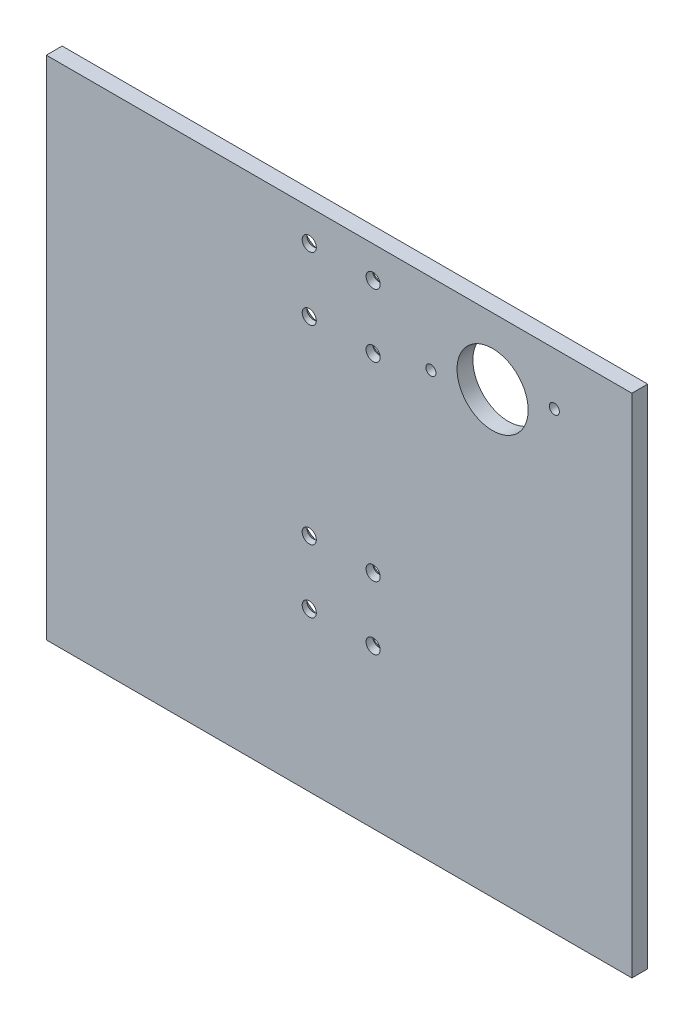
ISO-10303-21;
HEADER;
FILE_DESCRIPTION(('STEP AP214'),'2;1');
FILE_NAME('part.step','',(''),(''),'','','');
FILE_SCHEMA(('AUTOMOTIVE_DESIGN { 1 0 10303 214 1 1 1 1 }'));
ENDSEC;
DATA;
#1=APPLICATION_CONTEXT('core data for automotive mechanical design processes');
#2=APPLICATION_PROTOCOL_DEFINITION('international standard','automotive_design',2000,#1);
#3=PRODUCT_CONTEXT('',#1,'mechanical');
#4=PRODUCT('Part','Part','',(#3));
#5=PRODUCT_RELATED_PRODUCT_CATEGORY('part','',(#4));
#6=PRODUCT_DEFINITION_FORMATION('','',#4);
#7=PRODUCT_DEFINITION_CONTEXT('part definition',#1,'design');
#8=PRODUCT_DEFINITION('design','',#6,#7);
#9=PRODUCT_DEFINITION_SHAPE('','',#8);
#10=(LENGTH_UNIT() NAMED_UNIT(*) SI_UNIT(.MILLI.,.METRE.));
#11=(NAMED_UNIT(*) PLANE_ANGLE_UNIT() SI_UNIT($,.RADIAN.));
#12=(NAMED_UNIT(*) SI_UNIT($,.STERADIAN.) SOLID_ANGLE_UNIT());
#13=UNCERTAINTY_MEASURE_WITH_UNIT(LENGTH_MEASURE(1.E-05),#10,'distance_accuracy_value','');
#14=(GEOMETRIC_REPRESENTATION_CONTEXT(3) GLOBAL_UNCERTAINTY_ASSIGNED_CONTEXT((#13)) GLOBAL_UNIT_ASSIGNED_CONTEXT((#10,
#11,#12)) REPRESENTATION_CONTEXT('',''));
#15=CARTESIAN_POINT('',(0.,0.,0.));
#16=DIRECTION('',(0.,0.,1.));
#17=DIRECTION('',(1.,0.,0.));
#18=AXIS2_PLACEMENT_3D('',#15,#16,#17);
#19=CARTESIAN_POINT('',(117.475,-101.6,6.35));
#20=DIRECTION('',(-1.,0.,0.));
#21=DIRECTION('',(0.,0.,1.));
#22=AXIS2_PLACEMENT_3D('',#19,#20,#21);
#23=PLANE('',#22);
#24=DIRECTION('',(0.,1.,0.));
#25=VECTOR('',#24,1.);
#26=CARTESIAN_POINT('',(117.475,-101.6,0.));
#27=LINE('',#26,#25);
#28=CARTESIAN_POINT('',(117.475,-101.6,0.));
#29=VERTEX_POINT('',#28);
#30=CARTESIAN_POINT('',(117.475,101.6,0.));
#31=VERTEX_POINT('',#30);
#32=EDGE_CURVE('E104',#29,#31,#27,.T.);
#33=ORIENTED_EDGE('',*,*,#32,.T.);
#34=DIRECTION('',(0.,0.,-1.));
#35=VECTOR('',#34,1.);
#36=CARTESIAN_POINT('',(117.475,101.6,6.35));
#37=LINE('',#36,#35);
#38=CARTESIAN_POINT('',(117.475,101.6,6.35));
#39=VERTEX_POINT('',#38);
#40=EDGE_CURVE('E11',#39,#31,#37,.T.);
#41=ORIENTED_EDGE('',*,*,#40,.F.);
#42=DIRECTION('',(0.,1.,0.));
#43=VECTOR('',#42,1.);
#44=CARTESIAN_POINT('',(117.475,-101.6,6.35));
#45=LINE('',#44,#43);
#46=CARTESIAN_POINT('',(117.475,-101.6,6.35));
#47=VERTEX_POINT('',#46);
#48=EDGE_CURVE('E91',#47,#39,#45,.T.);
#49=ORIENTED_EDGE('',*,*,#48,.F.);
#50=DIRECTION('',(0.,0.,-1.));
#51=VECTOR('',#50,1.);
#52=CARTESIAN_POINT('',(117.475,-101.6,6.35));
#53=LINE('',#52,#51);
#54=EDGE_CURVE('E100',#47,#29,#53,.T.);
#55=ORIENTED_EDGE('',*,*,#54,.T.);
#56=EDGE_LOOP('',(#33,#41,#49,#55));
#57=FACE_BOUND('',#56,.T.);
#58=ADVANCED_FACE('F38',(#57),#23,.F.);
#59=CARTESIAN_POINT('',(-117.475,101.6,6.35));
#60=DIRECTION('',(0.,-1.,0.));
#61=DIRECTION('',(0.,0.,-1.));
#62=AXIS2_PLACEMENT_3D('',#59,#60,#61);
#63=PLANE('',#62);
#64=DIRECTION('',(-1.,0.,0.));
#65=VECTOR('',#64,1.);
#66=CARTESIAN_POINT('',(-117.475,101.6,0.));
#67=LINE('',#66,#65);
#68=CARTESIAN_POINT('',(-117.475,101.6,0.));
#69=VERTEX_POINT('',#68);
#70=EDGE_CURVE('E95',#31,#69,#67,.T.);
#71=ORIENTED_EDGE('',*,*,#70,.T.);
#72=DIRECTION('',(0.,0.,-1.));
#73=VECTOR('',#72,1.);
#74=CARTESIAN_POINT('',(-117.475,101.6,6.35));
#75=LINE('',#74,#73);
#76=CARTESIAN_POINT('',(-117.475,101.6,6.35));
#77=VERTEX_POINT('',#76);
#78=EDGE_CURVE('E47',#77,#69,#75,.T.);
#79=ORIENTED_EDGE('',*,*,#78,.F.);
#80=DIRECTION('',(-1.,0.,0.));
#81=VECTOR('',#80,1.);
#82=CARTESIAN_POINT('',(-117.475,101.6,6.35));
#83=LINE('',#82,#81);
#84=EDGE_CURVE('E86',#39,#77,#83,.T.);
#85=ORIENTED_EDGE('',*,*,#84,.F.);
#86=ORIENTED_EDGE('',*,*,#40,.T.);
#87=EDGE_LOOP('',(#71,#79,#85,#86));
#88=FACE_BOUND('',#87,.T.);
#89=ADVANCED_FACE('F94',(#88),#63,.F.);
#90=CARTESIAN_POINT('',(-117.475,-101.6,6.35));
#91=DIRECTION('',(1.,0.,0.));
#92=DIRECTION('',(0.,0.,-1.));
#93=AXIS2_PLACEMENT_3D('',#90,#91,#92);
#94=PLANE('',#93);
#95=DIRECTION('',(0.,-1.,0.));
#96=VECTOR('',#95,1.);
#97=CARTESIAN_POINT('',(-117.475,-101.6,0.));
#98=LINE('',#97,#96);
#99=CARTESIAN_POINT('',(-117.475,-101.6,0.));
#100=VERTEX_POINT('',#99);
#101=EDGE_CURVE('E73',#69,#100,#98,.T.);
#102=ORIENTED_EDGE('',*,*,#101,.T.);
#103=DIRECTION('',(0.,0.,-1.));
#104=VECTOR('',#103,1.);
#105=CARTESIAN_POINT('',(-117.475,-101.6,6.35));
#106=LINE('',#105,#104);
#107=CARTESIAN_POINT('',(-117.475,-101.6,6.35));
#108=VERTEX_POINT('',#107);
#109=EDGE_CURVE('E96',#108,#100,#106,.T.);
#110=ORIENTED_EDGE('',*,*,#109,.F.);
#111=DIRECTION('',(0.,-1.,0.));
#112=VECTOR('',#111,1.);
#113=CARTESIAN_POINT('',(-117.475,-101.6,6.35));
#114=LINE('',#113,#112);
#115=EDGE_CURVE('E89',#77,#108,#114,.T.);
#116=ORIENTED_EDGE('',*,*,#115,.F.);
#117=ORIENTED_EDGE('',*,*,#78,.T.);
#118=EDGE_LOOP('',(#102,#110,#116,#117));
#119=FACE_BOUND('',#118,.T.);
#120=ADVANCED_FACE('F98',(#119),#94,.F.);
#121=CARTESIAN_POINT('',(-117.475,-101.6,6.35));
#122=DIRECTION('',(0.,1.,0.));
#123=DIRECTION('',(0.,0.,1.));
#124=AXIS2_PLACEMENT_3D('',#121,#122,#123);
#125=PLANE('',#124);
#126=DIRECTION('',(1.,0.,0.));
#127=VECTOR('',#126,1.);
#128=CARTESIAN_POINT('',(-117.475,-101.6,0.));
#129=LINE('',#128,#127);
#130=EDGE_CURVE('E79',#100,#29,#129,.T.);
#131=ORIENTED_EDGE('',*,*,#130,.T.);
#132=ORIENTED_EDGE('',*,*,#54,.F.);
#133=DIRECTION('',(1.,0.,0.));
#134=VECTOR('',#133,1.);
#135=CARTESIAN_POINT('',(-117.475,-101.6,6.35));
#136=LINE('',#135,#134);
#137=EDGE_CURVE('E56',#108,#47,#136,.T.);
#138=ORIENTED_EDGE('',*,*,#137,.F.);
#139=ORIENTED_EDGE('',*,*,#109,.T.);
#140=EDGE_LOOP('',(#131,#132,#138,#139));
#141=FACE_BOUND('',#140,.T.);
#142=ADVANCED_FACE('F203',(#141),#125,.F.);
#143=CARTESIAN_POINT('',(0.,0.,6.35));
#144=DIRECTION('',(0.,0.,-1.));
#145=DIRECTION('',(-1.,0.,0.));
#146=AXIS2_PLACEMENT_3D('',#143,#144,#145);
#147=PLANE('',#146);
#148=CARTESIAN_POINT('',(86.3555520435341,80.5934850148182,6.35));
#149=DIRECTION('',(0.,0.,-1.));
#150=DIRECTION('',(-1.,0.,0.));
#151=AXIS2_PLACEMENT_3D('',#148,#149,#150);
#152=CIRCLE('',#151,2.0193);
#153=CARTESIAN_POINT('',(84.3362520435341,80.5934850148182,6.35));
#154=VERTEX_POINT('',#153);
#155=EDGE_CURVE('E169',#154,#154,#152,.T.);
#156=ORIENTED_EDGE('',*,*,#155,.T.);
#157=EDGE_LOOP('',(#156));
#158=FACE_BOUND('',#157,.T.);
#159=CARTESIAN_POINT('',(36.834447956951,69.266514985468,6.35));
#160=DIRECTION('',(0.,0.,-1.));
#161=DIRECTION('',(-1.,0.,0.));
#162=AXIS2_PLACEMENT_3D('',#159,#160,#161);
#163=CIRCLE('',#162,2.0193);
#164=CARTESIAN_POINT('',(34.815147956951,69.266514985468,6.35));
#165=VERTEX_POINT('',#164);
#166=EDGE_CURVE('E178',#165,#165,#163,.T.);
#167=ORIENTED_EDGE('',*,*,#166,.T.);
#168=EDGE_LOOP('',(#167));
#169=FACE_BOUND('',#168,.T.);
#170=CARTESIAN_POINT('',(13.6552562516194,-38.0999999999797,6.35));
#171=DIRECTION('',(0.,0.,-1.));
#172=DIRECTION('',(-1.,0.,0.));
#173=AXIS2_PLACEMENT_3D('',#170,#171,#172);
#174=ELLIPSE('',#173,2.83258676501395,2.80669999999999);
#175=CARTESIAN_POINT('',(10.8226694866054,-38.0999999999797,6.35));
#176=VERTEX_POINT('',#175);
#177=EDGE_CURVE('E162',#176,#176,#174,.T.);
#178=ORIENTED_EDGE('',*,*,#177,.T.);
#179=EDGE_LOOP('',(#178));
#180=FACE_BOUND('',#179,.T.);
#181=CARTESIAN_POINT('',(13.6552562516194,-12.6999999999796,6.35));
#182=DIRECTION('',(0.,0.,-1.));
#183=DIRECTION('',(-1.,0.,0.));
#184=AXIS2_PLACEMENT_3D('',#181,#182,#183);
#185=ELLIPSE('',#184,2.83258676501395,2.80669999999999);
#186=CARTESIAN_POINT('',(10.8226694866054,-12.6999999999796,6.35));
#187=VERTEX_POINT('',#186);
#188=EDGE_CURVE('E156',#187,#187,#185,.T.);
#189=ORIENTED_EDGE('',*,*,#188,.T.);
#190=EDGE_LOOP('',(#189));
#191=FACE_BOUND('',#190,.T.);
#192=CARTESIAN_POINT('',(13.6551371688923,63.499999999998,6.35));
#193=DIRECTION('',(0.,0.,-1.));
#194=DIRECTION('',(-1.,0.,0.));
#195=AXIS2_PLACEMENT_3D('',#192,#193,#194);
#196=ELLIPSE('',#195,2.83258676501395,2.8067);
#197=CARTESIAN_POINT('',(10.8225504038783,63.499999999998,6.35));
#198=VERTEX_POINT('',#197);
#199=EDGE_CURVE('E149',#198,#198,#196,.T.);
#200=ORIENTED_EDGE('',*,*,#199,.T.);
#201=EDGE_LOOP('',(#200));
#202=FACE_BOUND('',#201,.T.);
#203=CARTESIAN_POINT('',(13.6551371688923,88.899999999998,6.35));
#204=DIRECTION('',(0.,0.,-1.));
#205=DIRECTION('',(-1.,0.,0.));
#206=AXIS2_PLACEMENT_3D('',#203,#204,#205);
#207=ELLIPSE('',#206,2.83258676501395,2.8067);
#208=CARTESIAN_POINT('',(10.8225504038783,88.899999999998,6.35));
#209=VERTEX_POINT('',#208);
#210=EDGE_CURVE('E145',#209,#209,#207,.T.);
#211=ORIENTED_EDGE('',*,*,#210,.T.);
#212=EDGE_LOOP('',(#211));
#213=FACE_BOUND('',#212,.T.);
#214=CARTESIAN_POINT('',(-11.9790131150228,-38.0999999999797,6.35));
#215=DIRECTION('',(0.,0.,-1.));
#216=DIRECTION('',(-1.,0.,0.));
#217=AXIS2_PLACEMENT_3D('',#214,#215,#216);
#218=ELLIPSE('',#217,2.83258676501394,2.80669999999998);
#219=CARTESIAN_POINT('',(-14.8115998800367,-38.0999999999797,6.35));
#220=VERTEX_POINT('',#219);
#221=EDGE_CURVE('E135',#220,#220,#218,.T.);
#222=ORIENTED_EDGE('',*,*,#221,.T.);
#223=EDGE_LOOP('',(#222));
#224=FACE_BOUND('',#223,.T.);
#225=CARTESIAN_POINT('',(-11.9790131150228,-12.6999999999797,6.35));
#226=DIRECTION('',(0.,0.,-1.));
#227=DIRECTION('',(-1.,0.,0.));
#228=AXIS2_PLACEMENT_3D('',#225,#226,#227);
#229=ELLIPSE('',#228,2.83258676501394,2.80669999999998);
#230=CARTESIAN_POINT('',(-14.8115998800367,-12.6999999999797,6.35));
#231=VERTEX_POINT('',#230);
#232=EDGE_CURVE('E131',#231,#231,#229,.T.);
#233=ORIENTED_EDGE('',*,*,#232,.T.);
#234=EDGE_LOOP('',(#233));
#235=FACE_BOUND('',#234,.T.);
#236=CARTESIAN_POINT('',(-11.9791321977499,63.499999999998,6.35));
#237=DIRECTION('',(0.,0.,-1.));
#238=DIRECTION('',(-1.,0.,0.));
#239=AXIS2_PLACEMENT_3D('',#236,#237,#238);
#240=ELLIPSE('',#239,2.83258676501394,2.80669999999998);
#241=CARTESIAN_POINT('',(-14.8117189627638,63.499999999998,6.35));
#242=VERTEX_POINT('',#241);
#243=EDGE_CURVE('E124',#242,#242,#240,.T.);
#244=ORIENTED_EDGE('',*,*,#243,.T.);
#245=EDGE_LOOP('',(#244));
#246=FACE_BOUND('',#245,.T.);
#247=CARTESIAN_POINT('',(-11.9791321977499,88.899999999998,6.35));
#248=DIRECTION('',(0.,0.,-1.));
#249=DIRECTION('',(-1.,0.,0.));
#250=AXIS2_PLACEMENT_3D('',#247,#248,#249);
#251=ELLIPSE('',#250,2.83258676501394,2.80669999999998);
#252=CARTESIAN_POINT('',(-14.8117189627638,88.899999999998,6.35));
#253=VERTEX_POINT('',#252);
#254=EDGE_CURVE('E113',#253,#253,#251,.T.);
#255=ORIENTED_EDGE('',*,*,#254,.T.);
#256=EDGE_LOOP('',(#255));
#257=FACE_BOUND('',#256,.T.);
#258=CARTESIAN_POINT('',(61.595,74.93,6.35));
#259=DIRECTION('',(0.,0.,1.));
#260=DIRECTION('',(1.,0.,0.));
#261=AXIS2_PLACEMENT_3D('',#258,#259,#260);
#262=CIRCLE('',#261,14.2748);
#263=CARTESIAN_POINT('',(75.8698,74.93,6.35));
#264=VERTEX_POINT('',#263);
#265=EDGE_CURVE('E120',#264,#264,#262,.T.);
#266=ORIENTED_EDGE('',*,*,#265,.F.);
#267=EDGE_LOOP('',(#266));
#268=FACE_BOUND('',#267,.T.);
#269=ORIENTED_EDGE('',*,*,#48,.T.);
#270=ORIENTED_EDGE('',*,*,#84,.T.);
#271=ORIENTED_EDGE('',*,*,#115,.T.);
#272=ORIENTED_EDGE('',*,*,#137,.T.);
#273=EDGE_LOOP('',(#269,#270,#271,#272));
#274=FACE_BOUND('',#273,.T.);
#275=ADVANCED_FACE('F87',(#158,#169,#180,#191,#202,#213,#224,#235,#246,#257,#268,#274),#147,.F.);
#276=CARTESIAN_POINT('',(0.,0.,0.));
#277=DIRECTION('',(0.,0.,-1.));
#278=DIRECTION('',(-1.,0.,0.));
#279=AXIS2_PLACEMENT_3D('',#276,#277,#278);
#280=PLANE('',#279);
#281=CARTESIAN_POINT('',(86.3555520435341,80.5934850148182,0.));
#282=DIRECTION('',(0.,0.,-1.));
#283=DIRECTION('',(-1.,0.,0.));
#284=AXIS2_PLACEMENT_3D('',#281,#282,#283);
#285=CIRCLE('',#284,2.0193);
#286=CARTESIAN_POINT('',(84.3362520435341,80.5934850148182,0.));
#287=VERTEX_POINT('',#286);
#288=EDGE_CURVE('E174',#287,#287,#285,.T.);
#289=ORIENTED_EDGE('',*,*,#288,.F.);
#290=EDGE_LOOP('',(#289));
#291=FACE_BOUND('',#290,.T.);
#292=CARTESIAN_POINT('',(36.834447956951,69.266514985468,0.));
#293=DIRECTION('',(0.,0.,-1.));
#294=DIRECTION('',(-1.,0.,0.));
#295=AXIS2_PLACEMENT_3D('',#292,#293,#294);
#296=CIRCLE('',#295,2.0193);
#297=CARTESIAN_POINT('',(34.815147956951,69.266514985468,0.));
#298=VERTEX_POINT('',#297);
#299=EDGE_CURVE('E418',#298,#298,#296,.T.);
#300=ORIENTED_EDGE('',*,*,#299,.F.);
#301=EDGE_LOOP('',(#300));
#302=FACE_BOUND('',#301,.T.);
#303=CARTESIAN_POINT('',(11.99269341617,-38.0999999999797,0.));
#304=DIRECTION('',(0.,0.,-1.));
#305=DIRECTION('',(-1.,0.,0.));
#306=AXIS2_PLACEMENT_3D('',#303,#304,#305);
#307=ELLIPSE('',#306,5.86302039330875,5.75535830614865);
#308=CARTESIAN_POINT('',(6.12967302286121,-38.0999999999797,0.));
#309=VERTEX_POINT('',#308);
#310=EDGE_CURVE('E41',#309,#309,#307,.T.);
#311=ORIENTED_EDGE('',*,*,#310,.F.);
#312=EDGE_LOOP('',(#311));
#313=FACE_BOUND('',#312,.T.);
#314=CARTESIAN_POINT('',(11.99269341617,-12.6999999999796,0.));
#315=DIRECTION('',(0.,0.,-1.));
#316=DIRECTION('',(-1.,0.,0.));
#317=AXIS2_PLACEMENT_3D('',#314,#315,#316);
#318=ELLIPSE('',#317,5.86302039330875,5.75535830614865);
#319=CARTESIAN_POINT('',(6.12967302286121,-12.6999999999796,0.));
#320=VERTEX_POINT('',#319);
#321=EDGE_CURVE('E159',#320,#320,#318,.T.);
#322=ORIENTED_EDGE('',*,*,#321,.F.);
#323=EDGE_LOOP('',(#322));
#324=FACE_BOUND('',#323,.T.);
#325=CARTESIAN_POINT('',(11.9925720849973,63.499999999998,0.));
#326=DIRECTION('',(0.,0.,-1.));
#327=DIRECTION('',(-1.,0.,0.));
#328=AXIS2_PLACEMENT_3D('',#325,#326,#327);
#329=ELLIPSE('',#328,5.86303691016468,5.75537451970712);
#330=CARTESIAN_POINT('',(6.12953517483267,63.499999999998,0.));
#331=VERTEX_POINT('',#330);
#332=EDGE_CURVE('E152',#331,#331,#329,.T.);
#333=ORIENTED_EDGE('',*,*,#332,.F.);
#334=EDGE_LOOP('',(#333));
#335=FACE_BOUND('',#334,.T.);
#336=CARTESIAN_POINT('',(11.9925720849973,88.899999999998,0.));
#337=DIRECTION('',(0.,0.,-1.));
#338=DIRECTION('',(-1.,0.,0.));
#339=AXIS2_PLACEMENT_3D('',#336,#337,#338);
#340=ELLIPSE('',#339,5.86303691016468,5.75537451970712);
#341=CARTESIAN_POINT('',(6.12953517483267,88.899999999998,0.));
#342=VERTEX_POINT('',#341);
#343=EDGE_CURVE('E142',#342,#342,#340,.T.);
#344=ORIENTED_EDGE('',*,*,#343,.F.);
#345=EDGE_LOOP('',(#344));
#346=FACE_BOUND('',#345,.T.);
#347=CARTESIAN_POINT('',(-13.7700371030998,-38.0999999999797,0.));
#348=DIRECTION('',(0.,0.,-1.));
#349=DIRECTION('',(-1.,0.,0.));
#350=AXIS2_PLACEMENT_3D('',#347,#348,#349);
#351=ELLIPSE('',#350,6.80668317906114,6.68169270170725);
#352=CARTESIAN_POINT('',(-20.5767202821609,-38.0999999999797,0.));
#353=VERTEX_POINT('',#352);
#354=EDGE_CURVE('E138',#353,#353,#351,.T.);
#355=ORIENTED_EDGE('',*,*,#354,.F.);
#356=EDGE_LOOP('',(#355));
#357=FACE_BOUND('',#356,.T.);
#358=CARTESIAN_POINT('',(-13.7700371030998,-12.6999999999797,0.));
#359=DIRECTION('',(0.,0.,-1.));
#360=DIRECTION('',(-1.,0.,0.));
#361=AXIS2_PLACEMENT_3D('',#358,#359,#360);
#362=ELLIPSE('',#361,6.80668317906114,6.68169270170725);
#363=CARTESIAN_POINT('',(-20.5767202821609,-12.6999999999797,0.));
#364=VERTEX_POINT('',#363);
#365=EDGE_CURVE('E128',#364,#364,#362,.T.);
#366=ORIENTED_EDGE('',*,*,#365,.F.);
#367=EDGE_LOOP('',(#366));
#368=FACE_BOUND('',#367,.T.);
#369=CARTESIAN_POINT('',(-13.7701584342724,63.499999999998,0.));
#370=DIRECTION('',(0.,0.,-1.));
#371=DIRECTION('',(-1.,0.,0.));
#372=AXIS2_PLACEMENT_3D('',#369,#370,#371);
#373=ELLIPSE('',#372,6.80669969591707,6.68170891526572);
#374=CARTESIAN_POINT('',(-20.5768581301895,63.499999999998,0.));
#375=VERTEX_POINT('',#374);
#376=EDGE_CURVE('E121',#375,#375,#373,.T.);
#377=ORIENTED_EDGE('',*,*,#376,.F.);
#378=EDGE_LOOP('',(#377));
#379=FACE_BOUND('',#378,.T.);
#380=CARTESIAN_POINT('',(-13.7701584342724,88.899999999998,0.));
#381=DIRECTION('',(0.,0.,-1.));
#382=DIRECTION('',(-1.,0.,0.));
#383=AXIS2_PLACEMENT_3D('',#380,#381,#382);
#384=ELLIPSE('',#383,6.80669969591707,6.68170891526572);
#385=CARTESIAN_POINT('',(-20.5768581301895,88.899999999998,0.));
#386=VERTEX_POINT('',#385);
#387=EDGE_CURVE('E116',#386,#386,#384,.T.);
#388=ORIENTED_EDGE('',*,*,#387,.F.);
#389=EDGE_LOOP('',(#388));
#390=FACE_BOUND('',#389,.T.);
#391=CARTESIAN_POINT('',(61.595,74.93,0.));
#392=DIRECTION('',(0.,0.,1.));
#393=DIRECTION('',(1.,0.,0.));
#394=AXIS2_PLACEMENT_3D('',#391,#392,#393);
#395=CIRCLE('',#394,14.2748);
#396=CARTESIAN_POINT('',(75.8698,74.93,0.));
#397=VERTEX_POINT('',#396);
#398=EDGE_CURVE('E107',#397,#397,#395,.T.);
#399=ORIENTED_EDGE('',*,*,#398,.T.);
#400=EDGE_LOOP('',(#399));
#401=FACE_BOUND('',#400,.T.);
#402=ORIENTED_EDGE('',*,*,#32,.F.);
#403=ORIENTED_EDGE('',*,*,#130,.F.);
#404=ORIENTED_EDGE('',*,*,#101,.F.);
#405=ORIENTED_EDGE('',*,*,#70,.F.);
#406=EDGE_LOOP('',(#402,#403,#404,#405));
#407=FACE_BOUND('',#406,.T.);
#408=ADVANCED_FACE('F202',(#291,#302,#313,#324,#335,#346,#357,#368,#379,#390,#401,#407),#280,.T.);
#409=CARTESIAN_POINT('',(61.595,74.93,0.));
#410=DIRECTION('',(0.,0.,1.));
#411=DIRECTION('',(1.,0.,0.));
#412=AXIS2_PLACEMENT_3D('',#409,#410,#411);
#413=CYLINDRICAL_SURFACE('',#412,14.2748);
#414=ORIENTED_EDGE('',*,*,#398,.F.);
#415=EDGE_LOOP('',(#414));
#416=FACE_BOUND('',#415,.T.);
#417=ORIENTED_EDGE('',*,*,#265,.T.);
#418=EDGE_LOOP('',(#417));
#419=FACE_BOUND('',#418,.T.);
#420=ADVANCED_FACE('F199',(#416,#419),#413,.F.);
#421=CARTESIAN_POINT('',(-13.1498181163309,88.899999999998,-2.24974173182089));
#422=DIRECTION('',(-0.134886274213767,0.,-0.990861086645716));
#423=DIRECTION('',(-0.990861086645716,0.,0.134886274213767));
#424=AXIS2_PLACEMENT_3D('',#421,#422,#423);
#425=CYLINDRICAL_SURFACE('',#424,2.80669999999998);
#426=CARTESIAN_POINT('',(-12.3292644444063,88.899999999998,3.77796351657101));
#427=DIRECTION('',(-0.134886274213767,0.,-0.990861086645716));
#428=DIRECTION('',(-0.990861086645716,0.,0.134886274213767));
#429=AXIS2_PLACEMENT_3D('',#426,#427,#428);
#430=CIRCLE('',#429,2.80669999999998);
#431=CARTESIAN_POINT('',(-15.1103142562948,88.899999999998,4.15654882240678));
#432=VERTEX_POINT('',#431);
#433=EDGE_CURVE('E117',#432,#432,#430,.T.);
#434=ORIENTED_EDGE('',*,*,#433,.T.);
#435=EDGE_LOOP('',(#434));
#436=FACE_BOUND('',#435,.T.);
#437=ORIENTED_EDGE('',*,*,#254,.F.);
#438=EDGE_LOOP('',(#437));
#439=FACE_BOUND('',#438,.T.);
#440=ADVANCED_FACE('F241',(#436,#439),#425,.F.);
#441=CARTESIAN_POINT('',(-13.1498181163309,88.899999999998,-2.24974173182089));
#442=DIRECTION('',(-0.134886274213767,0.,-0.990861086645716));
#443=DIRECTION('',(-0.990861086645716,0.,0.134886274213767));
#444=AXIS2_PLACEMENT_3D('',#441,#442,#443);
#445=CONICAL_SURFACE('',#444,8.89,0.785398163397448);
#446=ORIENTED_EDGE('',*,*,#387,.T.);
#447=EDGE_LOOP('',(#446));
#448=FACE_BOUND('',#447,.T.);
#449=ORIENTED_EDGE('',*,*,#433,.F.);
#450=EDGE_LOOP('',(#449));
#451=FACE_BOUND('',#450,.T.);
#452=ADVANCED_FACE('F250',(#448,#451),#445,.F.);
#453=CARTESIAN_POINT('',(-13.1498181163309,63.499999999998,-2.24974173182089));
#454=DIRECTION('',(-0.134886274213767,0.,-0.990861086645716));
#455=DIRECTION('',(-0.990861086645716,0.,0.134886274213767));
#456=AXIS2_PLACEMENT_3D('',#453,#454,#455);
#457=CYLINDRICAL_SURFACE('',#456,2.80669999999998);
#458=CARTESIAN_POINT('',(-12.3292644444063,63.499999999998,3.77796351657101));
#459=DIRECTION('',(-0.134886274213767,0.,-0.990861086645716));
#460=DIRECTION('',(-0.990861086645716,0.,0.134886274213767));
#461=AXIS2_PLACEMENT_3D('',#458,#459,#460);
#462=CIRCLE('',#461,2.80669999999998);
#463=CARTESIAN_POINT('',(-15.1103142562948,63.499999999998,4.15654882240678));
#464=VERTEX_POINT('',#463);
#465=EDGE_CURVE('E125',#464,#464,#462,.T.);
#466=ORIENTED_EDGE('',*,*,#465,.T.);
#467=EDGE_LOOP('',(#466));
#468=FACE_BOUND('',#467,.T.);
#469=ORIENTED_EDGE('',*,*,#243,.F.);
#470=EDGE_LOOP('',(#469));
#471=FACE_BOUND('',#470,.T.);
#472=ADVANCED_FACE('F259',(#468,#471),#457,.F.);
#473=CARTESIAN_POINT('',(-13.1498181163309,63.499999999998,-2.24974173182089));
#474=DIRECTION('',(-0.134886274213767,0.,-0.990861086645716));
#475=DIRECTION('',(-0.990861086645716,0.,0.134886274213767));
#476=AXIS2_PLACEMENT_3D('',#473,#474,#475);
#477=CONICAL_SURFACE('',#476,8.89,0.785398163397448);
#478=ORIENTED_EDGE('',*,*,#376,.T.);
#479=EDGE_LOOP('',(#478));
#480=FACE_BOUND('',#479,.T.);
#481=ORIENTED_EDGE('',*,*,#465,.F.);
#482=EDGE_LOOP('',(#481));
#483=FACE_BOUND('',#482,.T.);
#484=ADVANCED_FACE('F268',(#480,#483),#477,.F.);
#485=CARTESIAN_POINT('',(-13.1497012002315,-12.6999999999797,-2.24975764765133));
#486=DIRECTION('',(-0.134886274213767,0.,-0.990861086645716));
#487=DIRECTION('',(-0.990861086645716,0.,0.134886274213767));
#488=AXIS2_PLACEMENT_3D('',#485,#486,#487);
#489=CYLINDRICAL_SURFACE('',#488,2.80669999999998);
#490=CARTESIAN_POINT('',(-12.3291475283068,-12.6999999999797,3.77794760074057));
#491=DIRECTION('',(-0.134886274213767,0.,-0.990861086645716));
#492=DIRECTION('',(-0.990861086645716,0.,0.134886274213767));
#493=AXIS2_PLACEMENT_3D('',#490,#491,#492);
#494=CIRCLE('',#493,2.80669999999999);
#495=CARTESIAN_POINT('',(-15.1101973401954,-12.6999999999797,4.15653290657635));
#496=VERTEX_POINT('',#495);
#497=EDGE_CURVE('E132',#496,#496,#494,.T.);
#498=ORIENTED_EDGE('',*,*,#497,.T.);
#499=EDGE_LOOP('',(#498));
#500=FACE_BOUND('',#499,.T.);
#501=ORIENTED_EDGE('',*,*,#232,.F.);
#502=EDGE_LOOP('',(#501));
#503=FACE_BOUND('',#502,.T.);
#504=ADVANCED_FACE('F277',(#500,#503),#489,.F.);
#505=CARTESIAN_POINT('',(-13.1497012002315,-12.6999999999797,-2.24975764765133));
#506=DIRECTION('',(-0.134886274213767,0.,-0.990861086645716));
#507=DIRECTION('',(-0.990861086645716,0.,0.134886274213767));
#508=AXIS2_PLACEMENT_3D('',#505,#506,#507);
#509=CONICAL_SURFACE('',#508,8.89,0.785398163397448);
#510=ORIENTED_EDGE('',*,*,#365,.T.);
#511=EDGE_LOOP('',(#510));
#512=FACE_BOUND('',#511,.T.);
#513=ORIENTED_EDGE('',*,*,#497,.F.);
#514=EDGE_LOOP('',(#513));
#515=FACE_BOUND('',#514,.T.);
#516=ADVANCED_FACE('F286',(#512,#515),#509,.F.);
#517=CARTESIAN_POINT('',(-13.1497012002315,-38.0999999999797,-2.24975764765133));
#518=DIRECTION('',(-0.134886274213767,0.,-0.990861086645716));
#519=DIRECTION('',(-0.990861086645716,0.,0.134886274213767));
#520=AXIS2_PLACEMENT_3D('',#517,#518,#519);
#521=CYLINDRICAL_SURFACE('',#520,2.80669999999998);
#522=CARTESIAN_POINT('',(-12.3291475283068,-38.0999999999797,3.77794760074057));
#523=DIRECTION('',(-0.134886274213767,0.,-0.990861086645716));
#524=DIRECTION('',(-0.990861086645716,0.,0.134886274213767));
#525=AXIS2_PLACEMENT_3D('',#522,#523,#524);
#526=CIRCLE('',#525,2.80669999999998);
#527=CARTESIAN_POINT('',(-15.1101973401954,-38.0999999999797,4.15653290657635));
#528=VERTEX_POINT('',#527);
#529=EDGE_CURVE('E139',#528,#528,#526,.T.);
#530=ORIENTED_EDGE('',*,*,#529,.T.);
#531=EDGE_LOOP('',(#530));
#532=FACE_BOUND('',#531,.T.);
#533=ORIENTED_EDGE('',*,*,#221,.F.);
#534=EDGE_LOOP('',(#533));
#535=FACE_BOUND('',#534,.T.);
#536=ADVANCED_FACE('F295',(#532,#535),#521,.F.);
#537=CARTESIAN_POINT('',(-13.1497012002315,-38.0999999999797,-2.24975764765133));
#538=DIRECTION('',(-0.134886274213767,0.,-0.990861086645716));
#539=DIRECTION('',(-0.990861086645716,0.,0.134886274213767));
#540=AXIS2_PLACEMENT_3D('',#537,#538,#539);
#541=CONICAL_SURFACE('',#540,8.89,0.785398163397449);
#542=ORIENTED_EDGE('',*,*,#354,.T.);
#543=EDGE_LOOP('',(#542));
#544=FACE_BOUND('',#543,.T.);
#545=ORIENTED_EDGE('',*,*,#529,.F.);
#546=EDGE_LOOP('',(#545));
#547=FACE_BOUND('',#546,.T.);
#548=ADVANCED_FACE('F304',(#544,#547),#541,.F.);
#549=CARTESIAN_POINT('',(12.3606646209733,88.899999999998,-3.15906593677059));
#550=DIRECTION('',(-0.134886274213767,0.,-0.990861086645716));
#551=DIRECTION('',(-0.990861086645716,0.,0.134886274213767));
#552=AXIS2_PLACEMENT_3D('',#549,#550,#551);
#553=CYLINDRICAL_SURFACE('',#552,2.8067);
#554=CARTESIAN_POINT('',(13.1812182928979,88.899999999998,2.86863931162129));
#555=DIRECTION('',(-0.134886274213767,0.,-0.990861086645716));
#556=DIRECTION('',(-0.990861086645716,0.,0.134886274213767));
#557=AXIS2_PLACEMENT_3D('',#554,#555,#556);
#558=CIRCLE('',#557,2.8067);
#559=CARTESIAN_POINT('',(10.4001684810094,88.899999999998,3.24722461745707));
#560=VERTEX_POINT('',#559);
#561=EDGE_CURVE('E146',#560,#560,#558,.T.);
#562=ORIENTED_EDGE('',*,*,#561,.T.);
#563=EDGE_LOOP('',(#562));
#564=FACE_BOUND('',#563,.T.);
#565=ORIENTED_EDGE('',*,*,#210,.F.);
#566=EDGE_LOOP('',(#565));
#567=FACE_BOUND('',#566,.T.);
#568=ADVANCED_FACE('F313',(#564,#567),#553,.F.);
#569=CARTESIAN_POINT('',(12.3606646209733,88.899999999998,-3.15906593677059));
#570=DIRECTION('',(-0.134886274213767,0.,-0.990861086645716));
#571=DIRECTION('',(-0.990861086645716,0.,0.134886274213767));
#572=AXIS2_PLACEMENT_3D('',#569,#570,#571);
#573=CONICAL_SURFACE('',#572,8.89,0.785398163397448);
#574=ORIENTED_EDGE('',*,*,#343,.T.);
#575=EDGE_LOOP('',(#574));
#576=FACE_BOUND('',#575,.T.);
#577=ORIENTED_EDGE('',*,*,#561,.F.);
#578=EDGE_LOOP('',(#577));
#579=FACE_BOUND('',#578,.T.);
#580=ADVANCED_FACE('F322',(#576,#579),#573,.F.);
#581=CARTESIAN_POINT('',(12.3606646209733,63.499999999998,-3.15906593677059));
#582=DIRECTION('',(-0.134886274213767,0.,-0.990861086645716));
#583=DIRECTION('',(-0.990861086645716,0.,0.134886274213767));
#584=AXIS2_PLACEMENT_3D('',#581,#582,#583);
#585=CYLINDRICAL_SURFACE('',#584,2.8067);
#586=CARTESIAN_POINT('',(13.1812182928979,63.499999999998,2.86863931162129));
#587=DIRECTION('',(-0.134886274213767,0.,-0.990861086645716));
#588=DIRECTION('',(-0.990861086645716,0.,0.134886274213767));
#589=AXIS2_PLACEMENT_3D('',#586,#587,#588);
#590=CIRCLE('',#589,2.8067);
#591=CARTESIAN_POINT('',(10.4001684810094,63.499999999998,3.24722461745707));
#592=VERTEX_POINT('',#591);
#593=EDGE_CURVE('E153',#592,#592,#590,.T.);
#594=ORIENTED_EDGE('',*,*,#593,.T.);
#595=EDGE_LOOP('',(#594));
#596=FACE_BOUND('',#595,.T.);
#597=ORIENTED_EDGE('',*,*,#199,.F.);
#598=EDGE_LOOP('',(#597));
#599=FACE_BOUND('',#598,.T.);
#600=ADVANCED_FACE('F331',(#596,#599),#585,.F.);
#601=CARTESIAN_POINT('',(12.3606646209733,63.499999999998,-3.15906593677059));
#602=DIRECTION('',(-0.134886274213767,0.,-0.990861086645716));
#603=DIRECTION('',(-0.990861086645716,0.,0.134886274213767));
#604=AXIS2_PLACEMENT_3D('',#601,#602,#603);
#605=CONICAL_SURFACE('',#604,8.89,0.785398163397448);
#606=ORIENTED_EDGE('',*,*,#332,.T.);
#607=EDGE_LOOP('',(#606));
#608=FACE_BOUND('',#607,.T.);
#609=ORIENTED_EDGE('',*,*,#593,.F.);
#610=EDGE_LOOP('',(#609));
#611=FACE_BOUND('',#610,.T.);
#612=ADVANCED_FACE('F340',(#608,#611),#605,.F.);
#613=CARTESIAN_POINT('',(12.3607815370727,-12.6999999999796,-3.15908185260103));
#614=DIRECTION('',(-0.134886274213767,0.,-0.990861086645716));
#615=DIRECTION('',(-0.990861086645716,0.,0.134886274213767));
#616=AXIS2_PLACEMENT_3D('',#613,#614,#615);
#617=CYLINDRICAL_SURFACE('',#616,2.80669999999999);
#618=CARTESIAN_POINT('',(13.1813352089973,-12.6999999999796,2.86862339579086));
#619=DIRECTION('',(-0.134886274213767,0.,-0.990861086645716));
#620=DIRECTION('',(-0.990861086645716,0.,0.134886274213767));
#621=AXIS2_PLACEMENT_3D('',#618,#619,#620);
#622=CIRCLE('',#621,2.80669999999999);
#623=CARTESIAN_POINT('',(10.4002853971088,-12.6999999999796,3.24720870162663));
#624=VERTEX_POINT('',#623);
#625=EDGE_CURVE('E160',#624,#624,#622,.T.);
#626=ORIENTED_EDGE('',*,*,#625,.T.);
#627=EDGE_LOOP('',(#626));
#628=FACE_BOUND('',#627,.T.);
#629=ORIENTED_EDGE('',*,*,#188,.F.);
#630=EDGE_LOOP('',(#629));
#631=FACE_BOUND('',#630,.T.);
#632=ADVANCED_FACE('F349',(#628,#631),#617,.F.);
#633=CARTESIAN_POINT('',(12.3607815370727,-12.6999999999796,-3.15908185260103));
#634=DIRECTION('',(-0.134886274213767,0.,-0.990861086645716));
#635=DIRECTION('',(-0.990861086645716,0.,0.134886274213767));
#636=AXIS2_PLACEMENT_3D('',#633,#634,#635);
#637=CONICAL_SURFACE('',#636,8.89,0.785398163397449);
#638=ORIENTED_EDGE('',*,*,#321,.T.);
#639=EDGE_LOOP('',(#638));
#640=FACE_BOUND('',#639,.T.);
#641=ORIENTED_EDGE('',*,*,#625,.F.);
#642=EDGE_LOOP('',(#641));
#643=FACE_BOUND('',#642,.T.);
#644=ADVANCED_FACE('F358',(#640,#643),#637,.F.);
#645=CARTESIAN_POINT('',(12.3607815370727,-38.0999999999797,-3.15908185260103));
#646=DIRECTION('',(-0.134886274213767,0.,-0.990861086645716));
#647=DIRECTION('',(-0.990861086645716,0.,0.134886274213767));
#648=AXIS2_PLACEMENT_3D('',#645,#646,#647);
#649=CYLINDRICAL_SURFACE('',#648,2.80669999999999);
#650=CARTESIAN_POINT('',(13.1813352089973,-38.0999999999797,2.86862339579086));
#651=DIRECTION('',(-0.134886274213767,0.,-0.990861086645716));
#652=DIRECTION('',(-0.990861086645716,0.,0.134886274213767));
#653=AXIS2_PLACEMENT_3D('',#650,#651,#652);
#654=CIRCLE('',#653,2.80669999999999);
#655=CARTESIAN_POINT('',(10.4002853971088,-38.0999999999797,3.24720870162663));
#656=VERTEX_POINT('',#655);
#657=EDGE_CURVE('E164',#656,#656,#654,.T.);
#658=ORIENTED_EDGE('',*,*,#657,.T.);
#659=EDGE_LOOP('',(#658));
#660=FACE_BOUND('',#659,.T.);
#661=ORIENTED_EDGE('',*,*,#177,.F.);
#662=EDGE_LOOP('',(#661));
#663=FACE_BOUND('',#662,.T.);
#664=ADVANCED_FACE('F367',(#660,#663),#649,.F.);
#665=CARTESIAN_POINT('',(12.3607815370727,-38.0999999999797,-3.15908185260103));
#666=DIRECTION('',(-0.134886274213767,0.,-0.990861086645716));
#667=DIRECTION('',(-0.990861086645716,0.,0.134886274213767));
#668=AXIS2_PLACEMENT_3D('',#665,#666,#667);
#669=CONICAL_SURFACE('',#668,8.89,0.785398163397449);
#670=ORIENTED_EDGE('',*,*,#310,.T.);
#671=EDGE_LOOP('',(#670));
#672=FACE_BOUND('',#671,.T.);
#673=ORIENTED_EDGE('',*,*,#657,.F.);
#674=EDGE_LOOP('',(#673));
#675=FACE_BOUND('',#674,.T.);
#676=ADVANCED_FACE('F375',(#672,#675),#669,.F.);
#677=CARTESIAN_POINT('',(36.834447956951,69.266514985468,6.35));
#678=DIRECTION('',(0.,0.,-1.));
#679=DIRECTION('',(-1.,0.,0.));
#680=AXIS2_PLACEMENT_3D('',#677,#678,#679);
#681=CYLINDRICAL_SURFACE('',#680,2.0193);
#682=ORIENTED_EDGE('',*,*,#299,.T.);
#683=EDGE_LOOP('',(#682));
#684=FACE_BOUND('',#683,.T.);
#685=ORIENTED_EDGE('',*,*,#166,.F.);
#686=EDGE_LOOP('',(#685));
#687=FACE_BOUND('',#686,.T.);
#688=ADVANCED_FACE('F382',(#684,#687),#681,.F.);
#689=CARTESIAN_POINT('',(86.3555520435341,80.5934850148182,6.35));
#690=DIRECTION('',(0.,0.,-1.));
#691=DIRECTION('',(-1.,0.,0.));
#692=AXIS2_PLACEMENT_3D('',#689,#690,#691);
#693=CYLINDRICAL_SURFACE('',#692,2.0193);
#694=ORIENTED_EDGE('',*,*,#288,.T.);
#695=EDGE_LOOP('',(#694));
#696=FACE_BOUND('',#695,.T.);
#697=ORIENTED_EDGE('',*,*,#155,.F.);
#698=EDGE_LOOP('',(#697));
#699=FACE_BOUND('',#698,.T.);
#700=ADVANCED_FACE('F395',(#696,#699),#693,.F.);
#701=CLOSED_SHELL('',(#58,#89,#120,#142,#275,#408,#420,#440,#452,#472,#484,#504,#516,#536,#548,
#568,#580,#600,#612,#632,#644,#664,#676,#688,#700));
#702=MANIFOLD_SOLID_BREP('B2',#701);
#703=ADVANCED_BREP_SHAPE_REPRESENTATION('',(#18,#702),#14);
#704=SHAPE_DEFINITION_REPRESENTATION(#9,#703);
ENDSEC;
END-ISO-10303-21;
